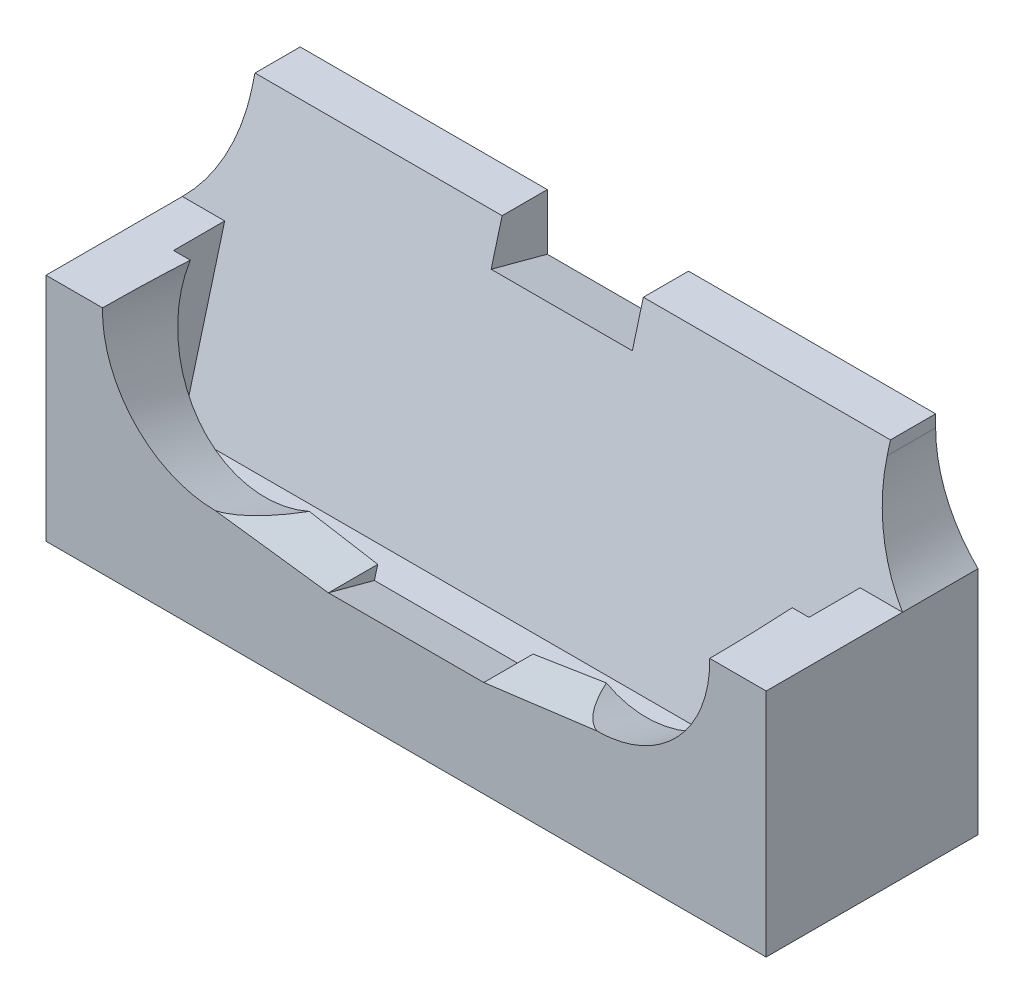
ISO-10303-21;
HEADER;
FILE_DESCRIPTION(('STEP AP214'),'2;1');
FILE_NAME('part.step','',(''),(''),'','','');
FILE_SCHEMA(('AUTOMOTIVE_DESIGN { 1 0 10303 214 1 1 1 1 }'));
ENDSEC;
DATA;
#1=APPLICATION_CONTEXT('core data for automotive mechanical design processes');
#2=APPLICATION_PROTOCOL_DEFINITION('international standard','automotive_design',2000,#1);
#3=PRODUCT_CONTEXT('',#1,'mechanical');
#4=PRODUCT('Part','Part','',(#3));
#5=PRODUCT_RELATED_PRODUCT_CATEGORY('part','',(#4));
#6=PRODUCT_DEFINITION_FORMATION('','',#4);
#7=PRODUCT_DEFINITION_CONTEXT('part definition',#1,'design');
#8=PRODUCT_DEFINITION('design','',#6,#7);
#9=PRODUCT_DEFINITION_SHAPE('','',#8);
#10=(LENGTH_UNIT() NAMED_UNIT(*) SI_UNIT(.MILLI.,.METRE.));
#11=(NAMED_UNIT(*) PLANE_ANGLE_UNIT() SI_UNIT($,.RADIAN.));
#12=(NAMED_UNIT(*) SI_UNIT($,.STERADIAN.) SOLID_ANGLE_UNIT());
#13=UNCERTAINTY_MEASURE_WITH_UNIT(LENGTH_MEASURE(1.E-05),#10,'distance_accuracy_value','');
#14=(GEOMETRIC_REPRESENTATION_CONTEXT(3) GLOBAL_UNCERTAINTY_ASSIGNED_CONTEXT((#13)) GLOBAL_UNIT_ASSIGNED_CONTEXT((#10,
#11,#12)) REPRESENTATION_CONTEXT('',''));
#15=CARTESIAN_POINT('',(0.,0.,0.));
#16=DIRECTION('',(0.,0.,1.));
#17=DIRECTION('',(1.,0.,0.));
#18=AXIS2_PLACEMENT_3D('',#15,#16,#17);
#19=CARTESIAN_POINT('',(-21.375,24.3185165257813,-9.54545454545456));
#20=DIRECTION('',(0.,1.,0.));
#21=DIRECTION('',(0.,0.,1.));
#22=AXIS2_PLACEMENT_3D('',#19,#20,#21);
#23=PLANE('',#22);
#24=DIRECTION('',(0.,0.,1.));
#25=VECTOR('',#24,1.);
#26=CARTESIAN_POINT('',(-3.87499999999952,24.3185165257813,-9.54545454545456));
#27=LINE('',#26,#25);
#28=CARTESIAN_POINT('',(-3.87499999999952,24.3185165257813,-9.54545454545456));
#29=VERTEX_POINT('',#28);
#30=CARTESIAN_POINT('',(-3.87499999999952,24.3185165257813,-6.34530207894035));
#31=VERTEX_POINT('',#30);
#32=EDGE_CURVE('E214',#29,#31,#27,.T.);
#33=ORIENTED_EDGE('',*,*,#32,.F.);
#34=DIRECTION('',(1.,0.,0.));
#35=VECTOR('',#34,1.);
#36=CARTESIAN_POINT('',(-21.375,24.3185165257813,-9.54545454545456));
#37=LINE('',#36,#35);
#38=CARTESIAN_POINT('',(-21.375,24.3185165257813,-9.54545454545456));
#39=VERTEX_POINT('',#38);
#40=EDGE_CURVE('E286',#39,#29,#37,.T.);
#41=ORIENTED_EDGE('',*,*,#40,.F.);
#42=DIRECTION('',(0.,0.,1.));
#43=VECTOR('',#42,1.);
#44=CARTESIAN_POINT('',(-21.375,24.3185165257813,-9.54545454545456));
#45=LINE('',#44,#43);
#46=CARTESIAN_POINT('',(-21.375,24.3185165257813,-6.34530207894035));
#47=VERTEX_POINT('',#46);
#48=EDGE_CURVE('E314',#39,#47,#45,.T.);
#49=ORIENTED_EDGE('',*,*,#48,.T.);
#50=DIRECTION('',(1.,0.,0.));
#51=VECTOR('',#50,1.);
#52=CARTESIAN_POINT('',(-21.375,24.3185165257813,-6.34530207894035));
#53=LINE('',#52,#51);
#54=EDGE_CURVE('E329',#47,#31,#53,.T.);
#55=ORIENTED_EDGE('',*,*,#54,.T.);
#56=EDGE_LOOP('',(#33,#41,#49,#55));
#57=FACE_BOUND('',#56,.T.);
#58=ADVANCED_FACE('F37',(#57),#23,.T.);
#59=CARTESIAN_POINT('',(23.625,5.,-9.54545454545454));
#60=DIRECTION('',(-1.,0.,0.));
#61=DIRECTION('',(0.,0.,1.));
#62=AXIS2_PLACEMENT_3D('',#59,#60,#61);
#63=PLANE('',#62);
#64=DIRECTION('',(0.,-0.965925826289067,0.258819045102525));
#65=VECTOR('',#64,1.);
#66=CARTESIAN_POINT('',(23.625,5.,-1.16892117688984));
#67=LINE('',#66,#65);
#68=CARTESIAN_POINT('',(23.625,24.3185165257813,-6.34530207894033));
#69=VERTEX_POINT('',#68);
#70=CARTESIAN_POINT('',(23.625,23.4599449543242,-6.11524851972406));
#71=VERTEX_POINT('',#70);
#72=EDGE_CURVE('E295',#69,#71,#67,.T.);
#73=ORIENTED_EDGE('',*,*,#72,.T.);
#74=DIRECTION('',(0.,0.,1.));
#75=VECTOR('',#74,1.);
#76=CARTESIAN_POINT('',(23.625,23.4599449543242,-9.54545454545454));
#77=LINE('',#76,#75);
#78=CARTESIAN_POINT('',(23.625,23.4599449543242,-9.54545454545454));
#79=VERTEX_POINT('',#78);
#80=EDGE_CURVE('E375',#71,#79,#77,.F.);
#81=ORIENTED_EDGE('',*,*,#80,.T.);
#82=DIRECTION('',(0.,-1.,0.));
#83=VECTOR('',#82,1.);
#84=CARTESIAN_POINT('',(23.625,5.,-9.54545454545454));
#85=LINE('',#84,#83);
#86=CARTESIAN_POINT('',(23.625,24.3185165257813,-9.54545454545454));
#87=VERTEX_POINT('',#86);
#88=EDGE_CURVE('E282',#87,#79,#85,.T.);
#89=ORIENTED_EDGE('',*,*,#88,.F.);
#90=DIRECTION('',(0.,0.,1.));
#91=VECTOR('',#90,1.);
#92=CARTESIAN_POINT('',(23.625,24.3185165257813,-9.54545454545454));
#93=LINE('',#92,#91);
#94=EDGE_CURVE('E309',#87,#69,#93,.T.);
#95=ORIENTED_EDGE('',*,*,#94,.T.);
#96=EDGE_LOOP('',(#73,#81,#89,#95));
#97=FACE_BOUND('',#96,.T.);
#98=ADVANCED_FACE('F411',(#97),#63,.F.);
#99=CARTESIAN_POINT('',(-21.375,5.,-9.54545454545454));
#100=DIRECTION('',(1.,0.,0.));
#101=DIRECTION('',(0.,0.,-1.));
#102=AXIS2_PLACEMENT_3D('',#99,#100,#101);
#103=PLANE('',#102);
#104=DIRECTION('',(0.,-1.,0.));
#105=VECTOR('',#104,1.);
#106=CARTESIAN_POINT('',(-21.375,5.,-9.54545454545454));
#107=LINE('',#106,#105);
#108=CARTESIAN_POINT('',(-21.375,23.4599449543242,-9.54545454545454));
#109=VERTEX_POINT('',#108);
#110=EDGE_CURVE('E287',#39,#109,#107,.T.);
#111=ORIENTED_EDGE('',*,*,#110,.T.);
#112=DIRECTION('',(0.,0.,1.));
#113=VECTOR('',#112,1.);
#114=CARTESIAN_POINT('',(-21.375,23.4599449543242,-9.54545454545454));
#115=LINE('',#114,#113);
#116=CARTESIAN_POINT('',(-21.375,23.4599449543242,-6.11524851972408));
#117=VERTEX_POINT('',#116);
#118=EDGE_CURVE('E371',#109,#117,#115,.T.);
#119=ORIENTED_EDGE('',*,*,#118,.T.);
#120=DIRECTION('',(0.,-0.965925826289067,0.258819045102525));
#121=VECTOR('',#120,1.);
#122=CARTESIAN_POINT('',(-21.375,5.,-1.16892117688986));
#123=LINE('',#122,#121);
#124=EDGE_CURVE('E319',#47,#117,#123,.T.);
#125=ORIENTED_EDGE('',*,*,#124,.F.);
#126=ORIENTED_EDGE('',*,*,#48,.F.);
#127=EDGE_LOOP('',(#111,#119,#125,#126));
#128=FACE_BOUND('',#127,.T.);
#129=ADVANCED_FACE('F401',(#128),#103,.F.);
#130=CARTESIAN_POINT('',(-12.375,17.2474487139159,9.52561326641087));
#131=DIRECTION('',(0.,-0.258819045102525,-0.965925826289067));
#132=DIRECTION('',(0.,0.965925826289067,-0.258819045102525));
#133=AXIS2_PLACEMENT_3D('',#130,#131,#132);
#134=CYLINDRICAL_SURFACE('',#133,8.);
#135=CARTESIAN_POINT('',(-12.375,16.1566093813942,5.45454545454545));
#136=DIRECTION('',(0.,0.,-1.));
#137=DIRECTION('',(0.,-1.,0.));
#138=AXIS2_PLACEMENT_3D('',#135,#136,#137);
#139=ELLIPSE('',#138,8.28220944328067,8.);
#140=CARTESIAN_POINT('',(-12.375,7.87439993811355,5.45454545454545));
#141=VERTEX_POINT('',#140);
#142=CARTESIAN_POINT('',(-20.3734712337107,16.3185165257813,5.45454545454545));
#143=VERTEX_POINT('',#142);
#144=EDGE_CURVE('E299',#141,#143,#139,.T.);
#145=ORIENTED_EDGE('',*,*,#144,.F.);
#146=CARTESIAN_POINT('',(-12.375,7.87439993811355,-25.4550809867043));
#147=DIRECTION('',(-0.128339346206567,-0.99173031223981,0.));
#148=DIRECTION('',(0.0340838954082749,-0.00441078063147196,-0.99940924204653));
#149=AXIS2_PLACEMENT_3D('',#146,#147,#148);
#150=ELLIPSE('',#149,31.1673708666227,8.);
#151=CARTESIAN_POINT('',(-9.39348541337638,7.48856355897898,1.78773685860349));
#152=VERTEX_POINT('',#151);
#153=EDGE_CURVE('E271',#141,#152,#150,.F.);
#154=ORIENTED_EDGE('',*,*,#153,.T.);
#155=CARTESIAN_POINT('',(-12.375,14.6592582628907,-0.133644996479807));
#156=DIRECTION('',(0.,-0.258819045102525,-0.965925826289067));
#157=DIRECTION('',(0.,0.965925826289067,-0.258819045102525));
#158=AXIS2_PLACEMENT_3D('',#155,#156,#157);
#159=CIRCLE('',#158,8.);
#160=CARTESIAN_POINT('',(-20.1883984669442,16.3185165257813,-0.578241908056033));
#161=VERTEX_POINT('',#160);
#162=EDGE_CURVE('E281',#152,#161,#159,.T.);
#163=ORIENTED_EDGE('',*,*,#162,.T.);
#164=CARTESIAN_POINT('',(-12.375,16.3185165257813,6.05879114350643));
#165=DIRECTION('',(0.,-1.,0.));
#166=DIRECTION('',(0.,0.,-1.));
#167=AXIS2_PLACEMENT_3D('',#164,#165,#166);
#168=ELLIPSE('',#167,30.9096264412497,8.);
#169=EDGE_CURVE('E304',#161,#143,#168,.F.);
#170=ORIENTED_EDGE('',*,*,#169,.T.);
#171=EDGE_LOOP('',(#145,#154,#163,#170));
#172=FACE_BOUND('',#171,.T.);
#173=ADVANCED_FACE('F433',(#172),#134,.F.);
#174=CARTESIAN_POINT('',(0.,5.,0.));
#175=DIRECTION('',(0.,1.,0.));
#176=DIRECTION('',(0.,0.,1.));
#177=AXIS2_PLACEMENT_3D('',#174,#175,#176);
#178=PLANE('',#177);
#179=DIRECTION('',(1.,0.,0.));
#180=VECTOR('',#179,1.);
#181=CARTESIAN_POINT('',(-21.375,5.,-1.16892117688986));
#182=LINE('',#181,#180);
#183=CARTESIAN_POINT('',(-21.375,5.,-1.16892117688986));
#184=VERTEX_POINT('',#183);
#185=CARTESIAN_POINT('',(23.625,5.,-1.16892117688984));
#186=VERTEX_POINT('',#185);
#187=EDGE_CURVE('E318',#184,#186,#182,.T.);
#188=ORIENTED_EDGE('',*,*,#187,.F.);
#189=DIRECTION('',(0.,0.,1.));
#190=VECTOR('',#189,1.);
#191=CARTESIAN_POINT('',(-21.375,5.,-9.54545454545454));
#192=LINE('',#191,#190);
#193=CARTESIAN_POINT('',(-21.375,5.,2.45454545454543));
#194=VERTEX_POINT('',#193);
#195=EDGE_CURVE('E302',#184,#194,#192,.T.);
#196=ORIENTED_EDGE('',*,*,#195,.T.);
#197=DIRECTION('',(1.,0.,0.));
#198=VECTOR('',#197,1.);
#199=CARTESIAN_POINT('',(-21.375,5.,2.45454545454543));
#200=LINE('',#199,#198);
#201=CARTESIAN_POINT('',(23.625,5.,2.45454545454544));
#202=VERTEX_POINT('',#201);
#203=EDGE_CURVE('E301',#194,#202,#200,.T.);
#204=ORIENTED_EDGE('',*,*,#203,.T.);
#205=DIRECTION('',(0.,0.,-1.));
#206=VECTOR('',#205,1.);
#207=CARTESIAN_POINT('',(23.625,5.,-9.54545454545454));
#208=LINE('',#207,#206);
#209=EDGE_CURVE('E291',#202,#186,#208,.T.);
#210=ORIENTED_EDGE('',*,*,#209,.T.);
#211=EDGE_LOOP('',(#188,#196,#204,#210));
#212=FACE_BOUND('',#211,.T.);
#213=ADVANCED_FACE('F447',(#212),#178,.T.);
#214=CARTESIAN_POINT('',(-21.375,5.,5.45454545454545));
#215=DIRECTION('',(0.,0.,-1.));
#216=DIRECTION('',(-1.,0.,0.));
#217=AXIS2_PLACEMENT_3D('',#214,#215,#216);
#218=PLANE('',#217);
#219=DIRECTION('',(-1.,0.,0.));
#220=VECTOR('',#219,1.);
#221=CARTESIAN_POINT('',(-21.375,6.83912375770347,5.45454545454545));
#222=LINE('',#221,#220);
#223=CARTESIAN_POINT('',(6.625,6.83912375770347,5.45454545454545));
#224=VERTEX_POINT('',#223);
#225=CARTESIAN_POINT('',(-4.375,6.83912375770347,5.45454545454546));
#226=VERTEX_POINT('',#225);
#227=EDGE_CURVE('E334',#224,#226,#222,.T.);
#228=ORIENTED_EDGE('',*,*,#227,.T.);
#229=DIRECTION('',(0.99173031223981,-0.128339346206567,0.));
#230=VECTOR('',#229,1.);
#231=CARTESIAN_POINT('',(-12.375,7.87439993811355,5.45454545454545));
#232=LINE('',#231,#230);
#233=EDGE_CURVE('E259',#141,#226,#232,.T.);
#234=ORIENTED_EDGE('',*,*,#233,.F.);
#235=ORIENTED_EDGE('',*,*,#144,.T.);
#236=DIRECTION('',(1.,0.,0.));
#237=VECTOR('',#236,1.);
#238=CARTESIAN_POINT('',(-21.375,16.3185165257813,5.45454545454545));
#239=LINE('',#238,#237);
#240=CARTESIAN_POINT('',(-24.375,16.3185165257813,5.45454545454546));
#241=VERTEX_POINT('',#240);
#242=EDGE_CURVE('E355',#241,#143,#239,.T.);
#243=ORIENTED_EDGE('',*,*,#242,.F.);
#244=DIRECTION('',(0.,1.,0.));
#245=VECTOR('',#244,1.);
#246=CARTESIAN_POINT('',(-24.375,16.3185165257813,5.45454545454546));
#247=LINE('',#246,#245);
#248=CARTESIAN_POINT('',(-24.375,0.,5.45454545454546));
#249=VERTEX_POINT('',#248);
#250=EDGE_CURVE('E246',#249,#241,#247,.T.);
#251=ORIENTED_EDGE('',*,*,#250,.F.);
#252=DIRECTION('',(1.,0.,0.));
#253=VECTOR('',#252,1.);
#254=CARTESIAN_POINT('',(-21.375,0.,5.45454545454545));
#255=LINE('',#254,#253);
#256=CARTESIAN_POINT('',(26.625,0.,5.45454545454546));
#257=VERTEX_POINT('',#256);
#258=EDGE_CURVE('E296',#249,#257,#255,.T.);
#259=ORIENTED_EDGE('',*,*,#258,.T.);
#260=DIRECTION('',(0.,-1.,0.));
#261=VECTOR('',#260,1.);
#262=CARTESIAN_POINT('',(26.625,16.3185165257813,5.45454545454546));
#263=LINE('',#262,#261);
#264=CARTESIAN_POINT('',(26.625,16.3185165257813,5.45454545454546));
#265=VERTEX_POINT('',#264);
#266=EDGE_CURVE('E230',#265,#257,#263,.T.);
#267=ORIENTED_EDGE('',*,*,#266,.F.);
#268=CARTESIAN_POINT('',(22.6234712337107,16.3185165257813,5.45454545454545));
#269=VERTEX_POINT('',#268);
#270=EDGE_CURVE('E341',#269,#265,#239,.T.);
#271=ORIENTED_EDGE('',*,*,#270,.F.);
#272=CARTESIAN_POINT('',(14.625,16.1566093813942,5.45454545454545));
#273=DIRECTION('',(0.,0.,-1.));
#274=DIRECTION('',(0.,-1.,0.));
#275=AXIS2_PLACEMENT_3D('',#272,#273,#274);
#276=ELLIPSE('',#275,8.28220944328067,8.);
#277=CARTESIAN_POINT('',(14.625,7.87439993811356,5.45454545454545));
#278=VERTEX_POINT('',#277);
#279=EDGE_CURVE('E290',#269,#278,#276,.T.);
#280=ORIENTED_EDGE('',*,*,#279,.T.);
#281=DIRECTION('',(0.99173031223981,0.128339346206566,0.));
#282=VECTOR('',#281,1.);
#283=CARTESIAN_POINT('',(6.625,6.83912375770347,5.45454545454545));
#284=LINE('',#283,#282);
#285=EDGE_CURVE('E261',#224,#278,#284,.T.);
#286=ORIENTED_EDGE('',*,*,#285,.F.);
#287=EDGE_LOOP('',(#228,#234,#235,#243,#251,#259,#267,#271,#280,#286));
#288=FACE_BOUND('',#287,.T.);
#289=ADVANCED_FACE('F427',(#288),#218,.F.);
#290=CARTESIAN_POINT('',(-21.375,5.,-9.54545454545454));
#291=DIRECTION('',(0.,0.,1.));
#292=DIRECTION('',(1.,0.,0.));
#293=AXIS2_PLACEMENT_3D('',#290,#291,#292);
#294=PLANE('',#293);
#295=ORIENTED_EDGE('',*,*,#40,.T.);
#296=DIRECTION('',(0.,-1.,0.));
#297=VECTOR('',#296,1.);
#298=CARTESIAN_POINT('',(-3.87499999999951,5.,-9.54545454545454));
#299=LINE('',#298,#297);
#300=CARTESIAN_POINT('',(-3.87499999999952,20.3552097154921,-9.54545454545454));
#301=VERTEX_POINT('',#300);
#302=EDGE_CURVE('E226',#29,#301,#299,.T.);
#303=ORIENTED_EDGE('',*,*,#302,.T.);
#304=DIRECTION('',(1.,0.,0.));
#305=VECTOR('',#304,1.);
#306=CARTESIAN_POINT('',(-21.375,20.3552097154921,-9.54545454545454));
#307=LINE('',#306,#305);
#308=CARTESIAN_POINT('',(6.12500000000002,20.3552097154921,-9.54545454545454));
#309=VERTEX_POINT('',#308);
#310=EDGE_CURVE('E204',#301,#309,#307,.T.);
#311=ORIENTED_EDGE('',*,*,#310,.T.);
#312=DIRECTION('',(0.,1.,0.));
#313=VECTOR('',#312,1.);
#314=CARTESIAN_POINT('',(6.12500000000002,5.00000000000001,-9.54545454545454));
#315=LINE('',#314,#313);
#316=CARTESIAN_POINT('',(6.12500000000002,24.3185165257813,-9.54545454545456));
#317=VERTEX_POINT('',#316);
#318=EDGE_CURVE('E222',#309,#317,#315,.T.);
#319=ORIENTED_EDGE('',*,*,#318,.T.);
#320=EDGE_CURVE('E294',#317,#87,#37,.T.);
#321=ORIENTED_EDGE('',*,*,#320,.T.);
#322=ORIENTED_EDGE('',*,*,#88,.T.);
#323=CARTESIAN_POINT('',(33.625,23.4599449543242,-9.54545454545454));
#324=DIRECTION('',(0.,0.,1.));
#325=DIRECTION('',(1.,0.,0.));
#326=AXIS2_PLACEMENT_3D('',#323,#324,#325);
#327=CIRCLE('',#326,10.);
#328=CARTESIAN_POINT('',(26.625,16.3185165257813,-9.54545454545454));
#329=VERTEX_POINT('',#328);
#330=EDGE_CURVE('E11',#79,#329,#327,.T.);
#331=ORIENTED_EDGE('',*,*,#330,.T.);
#332=DIRECTION('',(0.,1.,0.));
#333=VECTOR('',#332,1.);
#334=CARTESIAN_POINT('',(26.625,16.3185165257813,-9.54545454545454));
#335=LINE('',#334,#333);
#336=CARTESIAN_POINT('',(26.625,0.,-9.54545454545454));
#337=VERTEX_POINT('',#336);
#338=EDGE_CURVE('E236',#337,#329,#335,.T.);
#339=ORIENTED_EDGE('',*,*,#338,.F.);
#340=DIRECTION('',(-1.,0.,0.));
#341=VECTOR('',#340,1.);
#342=CARTESIAN_POINT('',(-21.375,0.,-9.54545454545454));
#343=LINE('',#342,#341);
#344=CARTESIAN_POINT('',(-24.375,0.,-9.54545454545454));
#345=VERTEX_POINT('',#344);
#346=EDGE_CURVE('E292',#337,#345,#343,.T.);
#347=ORIENTED_EDGE('',*,*,#346,.T.);
#348=DIRECTION('',(0.,-1.,0.));
#349=VECTOR('',#348,1.);
#350=CARTESIAN_POINT('',(-24.375,16.3185165257813,-9.54545454545455));
#351=LINE('',#350,#349);
#352=CARTESIAN_POINT('',(-24.375,16.3185165257813,-9.54545454545455));
#353=VERTEX_POINT('',#352);
#354=EDGE_CURVE('E253',#353,#345,#351,.T.);
#355=ORIENTED_EDGE('',*,*,#354,.F.);
#356=CARTESIAN_POINT('',(-31.375,23.4599449543242,-9.54545454545454));
#357=DIRECTION('',(0.,0.,1.));
#358=DIRECTION('',(1.,0.,0.));
#359=AXIS2_PLACEMENT_3D('',#356,#357,#358);
#360=CIRCLE('',#359,10.);
#361=EDGE_CURVE('E377',#353,#109,#360,.T.);
#362=ORIENTED_EDGE('',*,*,#361,.T.);
#363=ORIENTED_EDGE('',*,*,#110,.F.);
#364=EDGE_LOOP('',(#295,#303,#311,#319,#321,#322,#331,#339,#347,#355,#362,#363));
#365=FACE_BOUND('',#364,.T.);
#366=ADVANCED_FACE('F397',(#365),#294,.F.);
#367=CARTESIAN_POINT('',(0.,0.,0.));
#368=DIRECTION('',(0.,1.,0.));
#369=DIRECTION('',(0.,0.,1.));
#370=AXIS2_PLACEMENT_3D('',#367,#368,#369);
#371=PLANE('',#370);
#372=ORIENTED_EDGE('',*,*,#258,.F.);
#373=DIRECTION('',(0.,0.,1.));
#374=VECTOR('',#373,1.);
#375=CARTESIAN_POINT('',(-24.375,0.,5.45454545454546));
#376=LINE('',#375,#374);
#377=EDGE_CURVE('E256',#345,#249,#376,.T.);
#378=ORIENTED_EDGE('',*,*,#377,.F.);
#379=ORIENTED_EDGE('',*,*,#346,.F.);
#380=DIRECTION('',(0.,0.,-1.));
#381=VECTOR('',#380,1.);
#382=CARTESIAN_POINT('',(26.625,0.,5.45454545454546));
#383=LINE('',#382,#381);
#384=EDGE_CURVE('E233',#257,#337,#383,.T.);
#385=ORIENTED_EDGE('',*,*,#384,.F.);
#386=EDGE_LOOP('',(#372,#378,#379,#385));
#387=FACE_BOUND('',#386,.T.);
#388=ADVANCED_FACE('F424',(#387),#371,.F.);
#389=CARTESIAN_POINT('',(-21.375,5.,2.45454545454543));
#390=DIRECTION('',(0.,-0.258819045102525,-0.965925826289067));
#391=DIRECTION('',(0.,0.965925826289067,-0.258819045102525));
#392=AXIS2_PLACEMENT_3D('',#389,#390,#391);
#393=PLANE('',#392);
#394=DIRECTION('',(0.991144439670157,-0.128263528717052,0.0343681089381012));
#395=VECTOR('',#394,1.);
#396=CARTESIAN_POINT('',(-13.4143521489633,8.00890200347353,1.6483125926103));
#397=LINE('',#396,#395);
#398=CARTESIAN_POINT('',(-4.375,6.83912375770347,1.96175372888789));
#399=VERTEX_POINT('',#398);
#400=EDGE_CURVE('E263',#152,#399,#397,.T.);
#401=ORIENTED_EDGE('',*,*,#400,.T.);
#402=DIRECTION('',(0.,0.965925826289067,-0.258819045102525));
#403=VECTOR('',#402,1.);
#404=CARTESIAN_POINT('',(-4.375,5.96592582628907,2.19572640944292));
#405=LINE('',#404,#403);
#406=CARTESIAN_POINT('',(-4.375,5.96592582628907,2.19572640944292));
#407=VERTEX_POINT('',#406);
#408=EDGE_CURVE('E344',#407,#399,#405,.T.);
#409=ORIENTED_EDGE('',*,*,#408,.F.);
#410=DIRECTION('',(-1.,0.,0.));
#411=VECTOR('',#410,1.);
#412=CARTESIAN_POINT('',(6.625,5.96592582628907,2.19572640944292));
#413=LINE('',#412,#411);
#414=CARTESIAN_POINT('',(6.625,5.96592582628907,2.19572640944292));
#415=VERTEX_POINT('',#414);
#416=EDGE_CURVE('E340',#415,#407,#413,.T.);
#417=ORIENTED_EDGE('',*,*,#416,.F.);
#418=DIRECTION('',(0.,-0.965925826289067,0.258819045102525));
#419=VECTOR('',#418,1.);
#420=CARTESIAN_POINT('',(6.625,5.96592582628907,2.19572640944292));
#421=LINE('',#420,#419);
#422=CARTESIAN_POINT('',(6.625,6.83912375770347,1.9617537288879));
#423=VERTEX_POINT('',#422);
#424=EDGE_CURVE('E345',#423,#415,#421,.T.);
#425=ORIENTED_EDGE('',*,*,#424,.F.);
#426=DIRECTION('',(0.991144439670157,0.128263528717051,-0.0343681089381001));
#427=VECTOR('',#426,1.);
#428=CARTESIAN_POINT('',(7.67380148425915,6.9748486570325,1.92538635171989));
#429=LINE('',#428,#427);
#430=CARTESIAN_POINT('',(11.6434854133764,7.48856355897898,1.7877368586035));
#431=VERTEX_POINT('',#430);
#432=EDGE_CURVE('E268',#423,#431,#429,.T.);
#433=ORIENTED_EDGE('',*,*,#432,.T.);
#434=CARTESIAN_POINT('',(14.625,14.6592582628907,-0.133644996479797));
#435=DIRECTION('',(0.,-0.258819045102525,-0.965925826289067));
#436=DIRECTION('',(0.,0.965925826289067,-0.258819045102525));
#437=AXIS2_PLACEMENT_3D('',#434,#435,#436);
#438=CIRCLE('',#437,8.);
#439=CARTESIAN_POINT('',(22.4383984669442,16.3185165257813,-0.578241908056014));
#440=VERTEX_POINT('',#439);
#441=EDGE_CURVE('E331',#440,#431,#438,.T.);
#442=ORIENTED_EDGE('',*,*,#441,.F.);
#443=DIRECTION('',(1.,0.,0.));
#444=VECTOR('',#443,1.);
#445=CARTESIAN_POINT('',(-21.375,16.3185165257813,-0.578241908056033));
#446=LINE('',#445,#444);
#447=CARTESIAN_POINT('',(23.625,16.3185165257813,-0.578241908056019));
#448=VERTEX_POINT('',#447);
#449=EDGE_CURVE('E285',#440,#448,#446,.T.);
#450=ORIENTED_EDGE('',*,*,#449,.T.);
#451=DIRECTION('',(0.,0.965925826289067,-0.258819045102525));
#452=VECTOR('',#451,1.);
#453=CARTESIAN_POINT('',(23.625,5.,2.45454545454545));
#454=LINE('',#453,#452);
#455=EDGE_CURVE('E298',#202,#448,#454,.T.);
#456=ORIENTED_EDGE('',*,*,#455,.F.);
#457=ORIENTED_EDGE('',*,*,#203,.F.);
#458=DIRECTION('',(0.,0.965925826289067,-0.258819045102525));
#459=VECTOR('',#458,1.);
#460=CARTESIAN_POINT('',(-21.375,5.,2.45454545454543));
#461=LINE('',#460,#459);
#462=CARTESIAN_POINT('',(-21.375,16.3185165257813,-0.578241908056033));
#463=VERTEX_POINT('',#462);
#464=EDGE_CURVE('E310',#194,#463,#461,.T.);
#465=ORIENTED_EDGE('',*,*,#464,.T.);
#466=EDGE_CURVE('E313',#463,#161,#446,.T.);
#467=ORIENTED_EDGE('',*,*,#466,.T.);
#468=ORIENTED_EDGE('',*,*,#162,.F.);
#469=EDGE_LOOP('',(#401,#409,#417,#425,#433,#442,#450,#456,#457,#465,#467,#468));
#470=FACE_BOUND('',#469,.T.);
#471=ADVANCED_FACE('F436',(#470),#393,.T.);
#472=CARTESIAN_POINT('',(-21.375,5.,-1.16892117688986));
#473=DIRECTION('',(0.,0.258819045102525,0.965925826289067));
#474=DIRECTION('',(0.,-0.965925826289067,0.258819045102525));
#475=AXIS2_PLACEMENT_3D('',#472,#473,#474);
#476=PLANE('',#475);
#477=DIRECTION('',(0.,-0.965925826289067,0.258819045102525));
#478=VECTOR('',#477,1.);
#479=CARTESIAN_POINT('',(-3.87499999999952,28.8383024555971,-7.55637506879605));
#480=LINE('',#479,#478);
#481=CARTESIAN_POINT('',(-3.87499999999952,21.4207390469141,-5.56884494363277));
#482=VERTEX_POINT('',#481);
#483=EDGE_CURVE('E211',#31,#482,#480,.T.);
#484=ORIENTED_EDGE('',*,*,#483,.F.);
#485=ORIENTED_EDGE('',*,*,#54,.F.);
#486=ORIENTED_EDGE('',*,*,#124,.T.);
#487=CARTESIAN_POINT('',(-31.375,23.4599449543242,-6.11524851972409));
#488=DIRECTION('',(0.,0.258819045102525,0.965925826289067));
#489=DIRECTION('',(0.,-0.965925826289067,0.258819045102525));
#490=AXIS2_PLACEMENT_3D('',#487,#488,#489);
#491=ELLIPSE('',#490,10.3527618041008,10.);
#492=CARTESIAN_POINT('',(-24.375,16.3185165257813,-4.20170853949133));
#493=VERTEX_POINT('',#492);
#494=EDGE_CURVE('E379',#117,#493,#491,.F.);
#495=ORIENTED_EDGE('',*,*,#494,.T.);
#496=DIRECTION('',(-1.,0.,0.));
#497=VECTOR('',#496,1.);
#498=CARTESIAN_POINT('',(-21.375,16.3185165257813,-4.20170853949133));
#499=LINE('',#498,#497);
#500=CARTESIAN_POINT('',(-21.375,16.3185165257813,-4.20170853949133));
#501=VERTEX_POINT('',#500);
#502=EDGE_CURVE('E52',#501,#493,#499,.T.);
#503=ORIENTED_EDGE('',*,*,#502,.F.);
#504=EDGE_CURVE('E322',#501,#184,#123,.T.);
#505=ORIENTED_EDGE('',*,*,#504,.T.);
#506=ORIENTED_EDGE('',*,*,#187,.T.);
#507=CARTESIAN_POINT('',(23.625,16.3185165257813,-4.20170853949131));
#508=VERTEX_POINT('',#507);
#509=EDGE_CURVE('E325',#508,#186,#67,.T.);
#510=ORIENTED_EDGE('',*,*,#509,.F.);
#511=DIRECTION('',(-1.,0.,0.));
#512=VECTOR('',#511,1.);
#513=CARTESIAN_POINT('',(-21.375,16.3185165257813,-4.20170853949133));
#514=LINE('',#513,#512);
#515=CARTESIAN_POINT('',(26.625,16.3185165257813,-4.20170853949131));
#516=VERTEX_POINT('',#515);
#517=EDGE_CURVE('E373',#516,#508,#514,.T.);
#518=ORIENTED_EDGE('',*,*,#517,.F.);
#519=CARTESIAN_POINT('',(33.625,23.4599449543242,-6.11524851972405));
#520=DIRECTION('',(0.,0.258819045102525,0.965925826289067));
#521=DIRECTION('',(0.,-0.965925826289067,0.258819045102525));
#522=AXIS2_PLACEMENT_3D('',#519,#520,#521);
#523=ELLIPSE('',#522,10.3527618041008,10.);
#524=EDGE_CURVE('E45',#516,#71,#523,.F.);
#525=ORIENTED_EDGE('',*,*,#524,.T.);
#526=ORIENTED_EDGE('',*,*,#72,.F.);
#527=CARTESIAN_POINT('',(6.12500000000001,24.3185165257813,-6.34530207894034));
#528=VERTEX_POINT('',#527);
#529=EDGE_CURVE('E317',#528,#69,#53,.T.);
#530=ORIENTED_EDGE('',*,*,#529,.F.);
#531=DIRECTION('',(0.,0.965925826289067,-0.258819045102525));
#532=VECTOR('',#531,1.);
#533=CARTESIAN_POINT('',(6.12500000000001,28.8383024555971,-7.55637506879605));
#534=LINE('',#533,#532);
#535=CARTESIAN_POINT('',(6.12500000000001,21.4207390469141,-5.56884494363277));
#536=VERTEX_POINT('',#535);
#537=EDGE_CURVE('E208',#536,#528,#534,.T.);
#538=ORIENTED_EDGE('',*,*,#537,.F.);
#539=DIRECTION('',(1.,0.,0.));
#540=VECTOR('',#539,1.);
#541=CARTESIAN_POINT('',(-3.87499999999952,21.4207390469141,-5.56884494363277));
#542=LINE('',#541,#540);
#543=EDGE_CURVE('E201',#482,#536,#542,.T.);
#544=ORIENTED_EDGE('',*,*,#543,.F.);
#545=EDGE_LOOP('',(#484,#485,#486,#495,#503,#505,#506,#510,#518,#525,#526,#530,#538,#544));
#546=FACE_BOUND('',#545,.T.);
#547=ADVANCED_FACE('F217',(#546),#476,.T.);
#548=DIRECTION('',(0.,0.,-1.));
#549=VECTOR('',#548,1.);
#550=CARTESIAN_POINT('',(6.12500000000002,24.3185165257813,-9.54545454545456));
#551=LINE('',#550,#549);
#552=EDGE_CURVE('E359',#528,#317,#551,.T.);
#553=ORIENTED_EDGE('',*,*,#552,.F.);
#554=ORIENTED_EDGE('',*,*,#529,.T.);
#555=ORIENTED_EDGE('',*,*,#94,.F.);
#556=ORIENTED_EDGE('',*,*,#320,.F.);
#557=EDGE_LOOP('',(#553,#554,#555,#556));
#558=FACE_BOUND('',#557,.T.);
#559=ADVANCED_FACE('F409',(#558),#23,.T.);
#560=CARTESIAN_POINT('',(14.625,17.2474487139159,9.52561326641088));
#561=DIRECTION('',(0.,-0.258819045102525,-0.965925826289067));
#562=DIRECTION('',(0.,0.965925826289067,-0.258819045102525));
#563=AXIS2_PLACEMENT_3D('',#560,#561,#562);
#564=CYLINDRICAL_SURFACE('',#563,8.);
#565=ORIENTED_EDGE('',*,*,#441,.T.);
#566=CARTESIAN_POINT('',(14.625,7.87439993811356,-25.4550809867043));
#567=DIRECTION('',(0.128339346206566,-0.99173031223981,0.));
#568=DIRECTION('',(-0.0340838954082739,-0.00441078063147181,-0.99940924204653));
#569=AXIS2_PLACEMENT_3D('',#566,#567,#568);
#570=ELLIPSE('',#569,31.1673708666227,8.);
#571=EDGE_CURVE('E278',#431,#278,#570,.F.);
#572=ORIENTED_EDGE('',*,*,#571,.T.);
#573=ORIENTED_EDGE('',*,*,#279,.F.);
#574=CARTESIAN_POINT('',(14.625,16.3185165257813,6.05879114350643));
#575=DIRECTION('',(0.,-1.,0.));
#576=DIRECTION('',(0.,0.,-1.));
#577=AXIS2_PLACEMENT_3D('',#574,#575,#576);
#578=ELLIPSE('',#577,30.9096264412497,8.);
#579=EDGE_CURVE('E352',#269,#440,#578,.F.);
#580=ORIENTED_EDGE('',*,*,#579,.T.);
#581=EDGE_LOOP('',(#565,#572,#573,#580));
#582=FACE_BOUND('',#581,.T.);
#583=ADVANCED_FACE('F457',(#582),#564,.F.);
#584=CARTESIAN_POINT('',(-21.375,16.3185165257813,-48.1617773404768));
#585=DIRECTION('',(0.,-1.,0.));
#586=DIRECTION('',(0.,0.,-1.));
#587=AXIS2_PLACEMENT_3D('',#584,#585,#586);
#588=PLANE('',#587);
#589=DIRECTION('',(0.,0.,-1.));
#590=VECTOR('',#589,1.);
#591=CARTESIAN_POINT('',(-21.375,16.3185165257813,5.45454545454545));
#592=LINE('',#591,#590);
#593=EDGE_CURVE('E243',#463,#501,#592,.T.);
#594=ORIENTED_EDGE('',*,*,#593,.T.);
#595=ORIENTED_EDGE('',*,*,#502,.T.);
#596=DIRECTION('',(0.,0.,-1.));
#597=VECTOR('',#596,1.);
#598=CARTESIAN_POINT('',(-24.375,16.3185165257813,5.45454545454546));
#599=LINE('',#598,#597);
#600=EDGE_CURVE('E250',#241,#493,#599,.T.);
#601=ORIENTED_EDGE('',*,*,#600,.F.);
#602=ORIENTED_EDGE('',*,*,#242,.T.);
#603=ORIENTED_EDGE('',*,*,#169,.F.);
#604=ORIENTED_EDGE('',*,*,#466,.F.);
#605=EDGE_LOOP('',(#594,#595,#601,#602,#603,#604));
#606=FACE_BOUND('',#605,.T.);
#607=ADVANCED_FACE('F387',(#606),#588,.F.);
#608=DIRECTION('',(0.,0.,1.));
#609=VECTOR('',#608,1.);
#610=CARTESIAN_POINT('',(26.625,16.3185165257813,5.45454545454546));
#611=LINE('',#610,#609);
#612=EDGE_CURVE('E239',#516,#265,#611,.T.);
#613=ORIENTED_EDGE('',*,*,#612,.F.);
#614=ORIENTED_EDGE('',*,*,#517,.T.);
#615=DIRECTION('',(0.,0.,1.));
#616=VECTOR('',#615,1.);
#617=CARTESIAN_POINT('',(23.625,16.3185165257813,5.45454545454545));
#618=LINE('',#617,#616);
#619=EDGE_CURVE('E229',#508,#448,#618,.T.);
#620=ORIENTED_EDGE('',*,*,#619,.T.);
#621=ORIENTED_EDGE('',*,*,#449,.F.);
#622=ORIENTED_EDGE('',*,*,#579,.F.);
#623=ORIENTED_EDGE('',*,*,#270,.T.);
#624=EDGE_LOOP('',(#613,#614,#620,#621,#622,#623));
#625=FACE_BOUND('',#624,.T.);
#626=ADVANCED_FACE('F453',(#625),#588,.F.);
#627=CARTESIAN_POINT('',(6.625,7.64824961945548,8.47424428032186));
#628=DIRECTION('',(0.,-0.965925826289067,0.258819045102525));
#629=DIRECTION('',(0.,-0.258819045102525,-0.965925826289067));
#630=AXIS2_PLACEMENT_3D('',#627,#628,#629);
#631=PLANE('',#630);
#632=DIRECTION('',(0.,-0.258819045102525,-0.965925826289067));
#633=VECTOR('',#632,1.);
#634=CARTESIAN_POINT('',(6.625,7.64824961945548,8.47424428032186));
#635=LINE('',#634,#633);
#636=EDGE_CURVE('E337',#224,#415,#635,.T.);
#637=ORIENTED_EDGE('',*,*,#636,.T.);
#638=ORIENTED_EDGE('',*,*,#416,.T.);
#639=DIRECTION('',(0.,-0.258819045102525,-0.965925826289067));
#640=VECTOR('',#639,1.);
#641=CARTESIAN_POINT('',(-4.375,7.64824961945548,8.47424428032186));
#642=LINE('',#641,#640);
#643=EDGE_CURVE('E342',#226,#407,#642,.T.);
#644=ORIENTED_EDGE('',*,*,#643,.F.);
#645=ORIENTED_EDGE('',*,*,#227,.F.);
#646=EDGE_LOOP('',(#637,#638,#644,#645));
#647=FACE_BOUND('',#646,.T.);
#648=ADVANCED_FACE('F469',(#647),#631,.F.);
#649=CARTESIAN_POINT('',(6.625,7.64824961945548,8.47424428032186));
#650=DIRECTION('',(1.,0.,0.));
#651=DIRECTION('',(0.,0.,-1.));
#652=AXIS2_PLACEMENT_3D('',#649,#650,#651);
#653=PLANE('',#652);
#654=ORIENTED_EDGE('',*,*,#636,.F.);
#655=DIRECTION('',(0.,0.,1.));
#656=VECTOR('',#655,1.);
#657=CARTESIAN_POINT('',(6.625,6.83912375770347,-28.8276095686428));
#658=LINE('',#657,#656);
#659=EDGE_CURVE('E272',#423,#224,#658,.T.);
#660=ORIENTED_EDGE('',*,*,#659,.F.);
#661=ORIENTED_EDGE('',*,*,#424,.T.);
#662=EDGE_LOOP('',(#654,#660,#661));
#663=FACE_BOUND('',#662,.T.);
#664=ADVANCED_FACE('F466',(#663),#653,.F.);
#665=CARTESIAN_POINT('',(-4.375,7.64824961945548,8.47424428032186));
#666=DIRECTION('',(-1.,0.,0.));
#667=DIRECTION('',(0.,0.,1.));
#668=AXIS2_PLACEMENT_3D('',#665,#666,#667);
#669=PLANE('',#668);
#670=ORIENTED_EDGE('',*,*,#408,.T.);
#671=DIRECTION('',(0.,0.,1.));
#672=VECTOR('',#671,1.);
#673=CARTESIAN_POINT('',(-4.375,6.83912375770347,-28.8276095686428));
#674=LINE('',#673,#672);
#675=EDGE_CURVE('E267',#399,#226,#674,.T.);
#676=ORIENTED_EDGE('',*,*,#675,.T.);
#677=ORIENTED_EDGE('',*,*,#643,.T.);
#678=EDGE_LOOP('',(#670,#676,#677));
#679=FACE_BOUND('',#678,.T.);
#680=ADVANCED_FACE('F474',(#679),#669,.F.);
#681=CARTESIAN_POINT('',(-12.375,7.87439993811355,-28.8276095686428));
#682=DIRECTION('',(-0.128339346206567,-0.99173031223981,0.));
#683=DIRECTION('',(0.99173031223981,-0.128339346206567,0.));
#684=AXIS2_PLACEMENT_3D('',#681,#682,#683);
#685=PLANE('',#684);
#686=ORIENTED_EDGE('',*,*,#233,.T.);
#687=ORIENTED_EDGE('',*,*,#675,.F.);
#688=ORIENTED_EDGE('',*,*,#400,.F.);
#689=ORIENTED_EDGE('',*,*,#153,.F.);
#690=EDGE_LOOP('',(#686,#687,#688,#689));
#691=FACE_BOUND('',#690,.T.);
#692=ADVANCED_FACE('F472',(#691),#685,.F.);
#693=CARTESIAN_POINT('',(6.625,6.83912375770347,-28.8276095686428));
#694=DIRECTION('',(0.128339346206566,-0.99173031223981,0.));
#695=DIRECTION('',(0.99173031223981,0.128339346206566,0.));
#696=AXIS2_PLACEMENT_3D('',#693,#694,#695);
#697=PLANE('',#696);
#698=ORIENTED_EDGE('',*,*,#432,.F.);
#699=ORIENTED_EDGE('',*,*,#659,.T.);
#700=ORIENTED_EDGE('',*,*,#285,.T.);
#701=ORIENTED_EDGE('',*,*,#571,.F.);
#702=EDGE_LOOP('',(#698,#699,#700,#701));
#703=FACE_BOUND('',#702,.T.);
#704=ADVANCED_FACE('F460',(#703),#697,.F.);
#705=CARTESIAN_POINT('',(-21.375,0.,0.));
#706=DIRECTION('',(1.,0.,0.));
#707=DIRECTION('',(0.,0.,-1.));
#708=AXIS2_PLACEMENT_3D('',#705,#706,#707);
#709=PLANE('',#708);
#710=ORIENTED_EDGE('',*,*,#464,.F.);
#711=ORIENTED_EDGE('',*,*,#195,.F.);
#712=ORIENTED_EDGE('',*,*,#504,.F.);
#713=ORIENTED_EDGE('',*,*,#593,.F.);
#714=EDGE_LOOP('',(#710,#711,#712,#713));
#715=FACE_BOUND('',#714,.T.);
#716=ADVANCED_FACE('F442',(#715),#709,.T.);
#717=CARTESIAN_POINT('',(-24.375,0.,0.));
#718=DIRECTION('',(1.,0.,0.));
#719=DIRECTION('',(0.,0.,-1.));
#720=AXIS2_PLACEMENT_3D('',#717,#718,#719);
#721=PLANE('',#720);
#722=ORIENTED_EDGE('',*,*,#250,.T.);
#723=ORIENTED_EDGE('',*,*,#600,.T.);
#724=EDGE_CURVE('E249',#493,#353,#599,.T.);
#725=ORIENTED_EDGE('',*,*,#724,.T.);
#726=ORIENTED_EDGE('',*,*,#354,.T.);
#727=ORIENTED_EDGE('',*,*,#377,.T.);
#728=EDGE_LOOP('',(#722,#723,#725,#726,#727));
#729=FACE_BOUND('',#728,.T.);
#730=ADVANCED_FACE('F392',(#729),#721,.F.);
#731=CARTESIAN_POINT('',(23.625,0.,0.));
#732=DIRECTION('',(1.,0.,0.));
#733=DIRECTION('',(0.,0.,-1.));
#734=AXIS2_PLACEMENT_3D('',#731,#732,#733);
#735=PLANE('',#734);
#736=ORIENTED_EDGE('',*,*,#209,.F.);
#737=ORIENTED_EDGE('',*,*,#455,.T.);
#738=ORIENTED_EDGE('',*,*,#619,.F.);
#739=ORIENTED_EDGE('',*,*,#509,.T.);
#740=EDGE_LOOP('',(#736,#737,#738,#739));
#741=FACE_BOUND('',#740,.T.);
#742=ADVANCED_FACE('F450',(#741),#735,.F.);
#743=CARTESIAN_POINT('',(26.625,0.,0.));
#744=DIRECTION('',(1.,0.,0.));
#745=DIRECTION('',(0.,0.,-1.));
#746=AXIS2_PLACEMENT_3D('',#743,#744,#745);
#747=PLANE('',#746);
#748=ORIENTED_EDGE('',*,*,#266,.T.);
#749=ORIENTED_EDGE('',*,*,#384,.T.);
#750=ORIENTED_EDGE('',*,*,#338,.T.);
#751=EDGE_CURVE('E240',#329,#516,#611,.T.);
#752=ORIENTED_EDGE('',*,*,#751,.T.);
#753=ORIENTED_EDGE('',*,*,#612,.T.);
#754=EDGE_LOOP('',(#748,#749,#750,#752,#753));
#755=FACE_BOUND('',#754,.T.);
#756=ADVANCED_FACE('F418',(#755),#747,.T.);
#757=CARTESIAN_POINT('',(-3.87499999999952,19.867824776299,-11.3643999013672));
#758=DIRECTION('',(0.,-0.965925826289067,0.258819045102525));
#759=DIRECTION('',(0.,-0.258819045102525,-0.965925826289067));
#760=AXIS2_PLACEMENT_3D('',#757,#758,#759);
#761=PLANE('',#760);
#762=DIRECTION('',(0.,0.258819045102525,0.965925826289067));
#763=VECTOR('',#762,1.);
#764=CARTESIAN_POINT('',(-3.87499999999952,19.867824776299,-11.3643999013672));
#765=LINE('',#764,#763);
#766=EDGE_CURVE('E196',#301,#482,#765,.T.);
#767=ORIENTED_EDGE('',*,*,#766,.T.);
#768=ORIENTED_EDGE('',*,*,#543,.T.);
#769=DIRECTION('',(0.,0.258819045102525,0.965925826289067));
#770=VECTOR('',#769,1.);
#771=CARTESIAN_POINT('',(6.12500000000002,19.867824776299,-11.3643999013672));
#772=LINE('',#771,#770);
#773=EDGE_CURVE('E207',#309,#536,#772,.T.);
#774=ORIENTED_EDGE('',*,*,#773,.F.);
#775=ORIENTED_EDGE('',*,*,#310,.F.);
#776=EDGE_LOOP('',(#767,#768,#774,#775));
#777=FACE_BOUND('',#776,.T.);
#778=ADVANCED_FACE('F198',(#777),#761,.F.);
#779=CARTESIAN_POINT('',(-3.87499999999952,27.285388184982,-13.3519300265305));
#780=DIRECTION('',(-1.,0.,0.));
#781=DIRECTION('',(0.,0.,1.));
#782=AXIS2_PLACEMENT_3D('',#779,#780,#781);
#783=PLANE('',#782);
#784=ORIENTED_EDGE('',*,*,#32,.T.);
#785=ORIENTED_EDGE('',*,*,#483,.T.);
#786=ORIENTED_EDGE('',*,*,#766,.F.);
#787=ORIENTED_EDGE('',*,*,#302,.F.);
#788=EDGE_LOOP('',(#784,#785,#786,#787));
#789=FACE_BOUND('',#788,.T.);
#790=ADVANCED_FACE('F212',(#789),#783,.F.);
#791=CARTESIAN_POINT('',(6.12500000000002,27.285388184982,-13.3519300265305));
#792=DIRECTION('',(1.,0.,0.));
#793=DIRECTION('',(0.,0.,-1.));
#794=AXIS2_PLACEMENT_3D('',#791,#792,#793);
#795=PLANE('',#794);
#796=ORIENTED_EDGE('',*,*,#773,.T.);
#797=ORIENTED_EDGE('',*,*,#537,.T.);
#798=ORIENTED_EDGE('',*,*,#552,.T.);
#799=ORIENTED_EDGE('',*,*,#318,.F.);
#800=EDGE_LOOP('',(#796,#797,#798,#799));
#801=FACE_BOUND('',#800,.T.);
#802=ADVANCED_FACE('F523',(#801),#795,.F.);
#803=CARTESIAN_POINT('',(-31.375,23.4599449543242,-48.1617773404768));
#804=DIRECTION('',(0.,0.,1.));
#805=DIRECTION('',(1.,0.,0.));
#806=AXIS2_PLACEMENT_3D('',#803,#804,#805);
#807=CYLINDRICAL_SURFACE('',#806,10.);
#808=ORIENTED_EDGE('',*,*,#494,.F.);
#809=ORIENTED_EDGE('',*,*,#118,.F.);
#810=ORIENTED_EDGE('',*,*,#361,.F.);
#811=ORIENTED_EDGE('',*,*,#724,.F.);
#812=EDGE_LOOP('',(#808,#809,#810,#811));
#813=FACE_BOUND('',#812,.T.);
#814=ADVANCED_FACE('F395',(#813),#807,.F.);
#815=CARTESIAN_POINT('',(33.625,23.4599449543242,-48.1617773404767));
#816=DIRECTION('',(0.,0.,1.));
#817=DIRECTION('',(1.,0.,0.));
#818=AXIS2_PLACEMENT_3D('',#815,#816,#817);
#819=CYLINDRICAL_SURFACE('',#818,10.);
#820=ORIENTED_EDGE('',*,*,#330,.F.);
#821=ORIENTED_EDGE('',*,*,#80,.F.);
#822=ORIENTED_EDGE('',*,*,#524,.F.);
#823=ORIENTED_EDGE('',*,*,#751,.F.);
#824=EDGE_LOOP('',(#820,#821,#822,#823));
#825=FACE_BOUND('',#824,.T.);
#826=ADVANCED_FACE('F39',(#825),#819,.F.);
#827=CLOSED_SHELL('',(#58,#98,#129,#173,#213,#289,#366,#388,#471,#547,#559,#583,#607,#626,#648,
#664,#680,#692,#704,#716,#730,#742,#756,#778,#790,#802,#814,#826));
#828=MANIFOLD_SOLID_BREP('B2',#827);
#829=ADVANCED_BREP_SHAPE_REPRESENTATION('',(#18,#828),#14);
#830=SHAPE_DEFINITION_REPRESENTATION(#9,#829);
ENDSEC;
END-ISO-10303-21;
